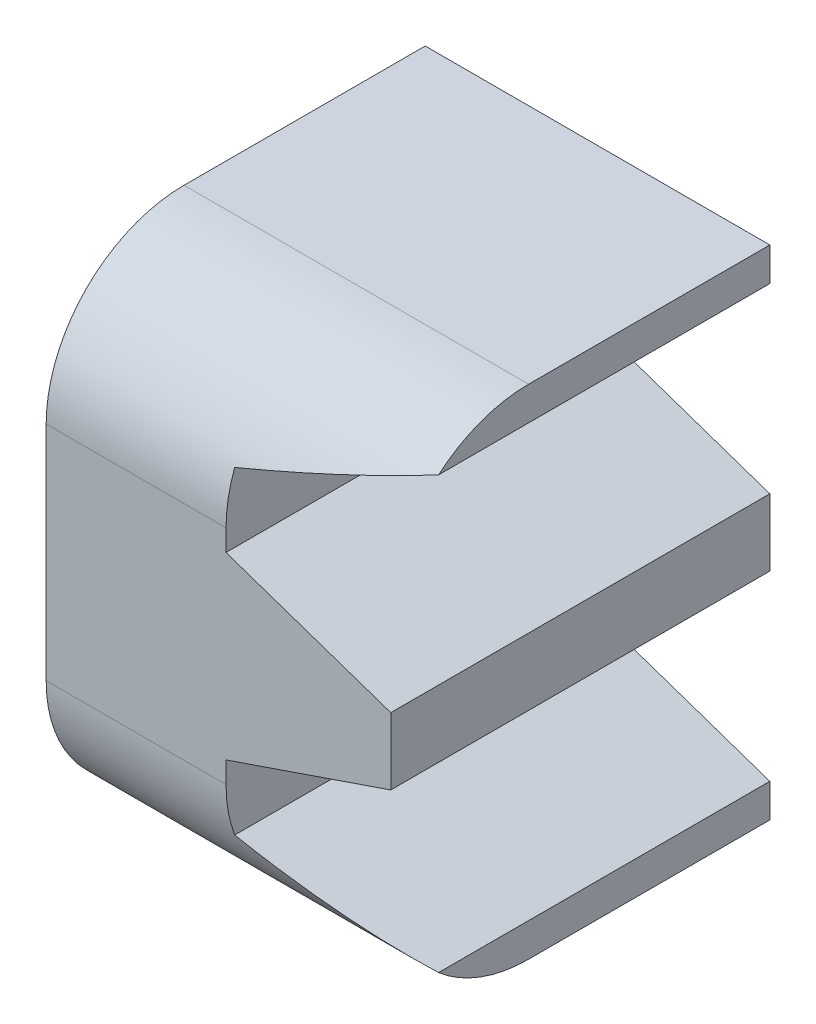
ISO-10303-21;
HEADER;
FILE_DESCRIPTION(('STEP AP214'),'2;1');
FILE_NAME('part.step','',(''),(''),'','','');
FILE_SCHEMA(('AUTOMOTIVE_DESIGN { 1 0 10303 214 1 1 1 1 }'));
ENDSEC;
DATA;
#1=APPLICATION_CONTEXT('core data for automotive mechanical design processes');
#2=APPLICATION_PROTOCOL_DEFINITION('international standard','automotive_design',2000,#1);
#3=PRODUCT_CONTEXT('',#1,'mechanical');
#4=PRODUCT('Part','Part','',(#3));
#5=PRODUCT_RELATED_PRODUCT_CATEGORY('part','',(#4));
#6=PRODUCT_DEFINITION_FORMATION('','',#4);
#7=PRODUCT_DEFINITION_CONTEXT('part definition',#1,'design');
#8=PRODUCT_DEFINITION('design','',#6,#7);
#9=PRODUCT_DEFINITION_SHAPE('','',#8);
#10=(LENGTH_UNIT() NAMED_UNIT(*) SI_UNIT(.MILLI.,.METRE.));
#11=(NAMED_UNIT(*) PLANE_ANGLE_UNIT() SI_UNIT($,.RADIAN.));
#12=(NAMED_UNIT(*) SI_UNIT($,.STERADIAN.) SOLID_ANGLE_UNIT());
#13=UNCERTAINTY_MEASURE_WITH_UNIT(LENGTH_MEASURE(1.E-05),#10,'distance_accuracy_value','');
#14=(GEOMETRIC_REPRESENTATION_CONTEXT(3) GLOBAL_UNCERTAINTY_ASSIGNED_CONTEXT((#13)) GLOBAL_UNIT_ASSIGNED_CONTEXT((#10,
#11,#12)) REPRESENTATION_CONTEXT('',''));
#15=CARTESIAN_POINT('',(0.,0.,0.));
#16=DIRECTION('',(0.,0.,1.));
#17=DIRECTION('',(1.,0.,0.));
#18=AXIS2_PLACEMENT_3D('',#15,#16,#17);
#19=CARTESIAN_POINT('',(2.75497762602042,-3.61288291082135,5.5));
#20=DIRECTION('',(0.,-1.,0.));
#21=DIRECTION('',(0.,0.,-1.));
#22=AXIS2_PLACEMENT_3D('',#19,#20,#21);
#23=PLANE('',#22);
#24=DIRECTION('',(0.,0.,-1.));
#25=VECTOR('',#24,1.);
#26=CARTESIAN_POINT('',(2.75497762602042,-3.61288291082135,5.5));
#27=LINE('',#26,#25);
#28=CARTESIAN_POINT('',(2.75497762602042,-3.61288291082135,3.5));
#29=VERTEX_POINT('',#28);
#30=CARTESIAN_POINT('',(2.75497762602042,-3.61288291082135,0.));
#31=VERTEX_POINT('',#30);
#32=EDGE_CURVE('E200',#29,#31,#27,.T.);
#33=ORIENTED_EDGE('',*,*,#32,.F.);
#34=DIRECTION('',(-1.,0.,0.));
#35=VECTOR('',#34,1.);
#36=CARTESIAN_POINT('',(-2.24502101432305,-3.61288291082135,3.5));
#37=LINE('',#36,#35);
#38=CARTESIAN_POINT('',(-2.24502101432305,-3.61288291082135,3.5));
#39=VERTEX_POINT('',#38);
#40=EDGE_CURVE('E202',#29,#39,#37,.T.);
#41=ORIENTED_EDGE('',*,*,#40,.T.);
#42=DIRECTION('',(0.,0.,-1.));
#43=VECTOR('',#42,1.);
#44=CARTESIAN_POINT('',(-2.24502101432305,-3.61288291082135,5.5));
#45=LINE('',#44,#43);
#46=CARTESIAN_POINT('',(-2.24502101432305,-3.61288291082135,0.));
#47=VERTEX_POINT('',#46);
#48=EDGE_CURVE('E170',#39,#47,#45,.T.);
#49=ORIENTED_EDGE('',*,*,#48,.T.);
#50=DIRECTION('',(-1.,0.,0.));
#51=VECTOR('',#50,1.);
#52=CARTESIAN_POINT('',(2.75497762602042,-3.61288291082135,0.));
#53=LINE('',#52,#51);
#54=EDGE_CURVE('E171',#31,#47,#53,.T.);
#55=ORIENTED_EDGE('',*,*,#54,.F.);
#56=EDGE_LOOP('',(#33,#41,#49,#55));
#57=FACE_BOUND('',#56,.T.);
#58=ADVANCED_FACE('F32',(#57),#23,.T.);
#59=CARTESIAN_POINT('',(2.75497762602042,-3.61288291082135,5.5));
#60=DIRECTION('',(-1.,0.,0.));
#61=DIRECTION('',(0.,0.,1.));
#62=AXIS2_PLACEMENT_3D('',#59,#60,#61);
#63=PLANE('',#62);
#64=DIRECTION('',(0.,0.,-1.));
#65=VECTOR('',#64,1.);
#66=CARTESIAN_POINT('',(2.75497762602042,-3.12702062488493,5.5));
#67=LINE('',#66,#65);
#68=CARTESIAN_POINT('',(2.75497762602042,-3.12702062488493,4.8066701890111));
#69=VERTEX_POINT('',#68);
#70=CARTESIAN_POINT('',(2.75497762602042,-3.12702062488493,0.));
#71=VERTEX_POINT('',#70);
#72=EDGE_CURVE('E203',#69,#71,#67,.T.);
#73=ORIENTED_EDGE('',*,*,#72,.F.);
#74=CARTESIAN_POINT('',(2.75497762602042,-1.61288291082135,3.5));
#75=DIRECTION('',(-1.,0.,0.));
#76=DIRECTION('',(0.,0.,1.));
#77=AXIS2_PLACEMENT_3D('',#74,#75,#76);
#78=CIRCLE('',#77,2.);
#79=EDGE_CURVE('E236',#69,#29,#78,.F.);
#80=ORIENTED_EDGE('',*,*,#79,.T.);
#81=ORIENTED_EDGE('',*,*,#32,.T.);
#82=DIRECTION('',(0.,1.,0.));
#83=VECTOR('',#82,1.);
#84=CARTESIAN_POINT('',(2.75497762602042,-3.61288291082135,0.));
#85=LINE('',#84,#83);
#86=EDGE_CURVE('E162',#31,#71,#85,.T.);
#87=ORIENTED_EDGE('',*,*,#86,.T.);
#88=EDGE_LOOP('',(#73,#80,#81,#87));
#89=FACE_BOUND('',#88,.T.);
#90=ADVANCED_FACE('F264',(#89),#63,.F.);
#91=CARTESIAN_POINT('',(2.75497762602042,-3.12702062488493,5.5));
#92=DIRECTION('',(-0.323615577118184,-0.946188648339466,0.));
#93=DIRECTION('',(0.946188648339466,-0.323615577118184,0.));
#94=AXIS2_PLACEMENT_3D('',#91,#92,#93);
#95=PLANE('',#94);
#96=DIRECTION('',(0.,0.,-1.));
#97=VECTOR('',#96,1.);
#98=CARTESIAN_POINT('',(0.364622856972072,-2.30947114417583,5.5));
#99=LINE('',#98,#97);
#100=CARTESIAN_POINT('',(0.364622856972072,-2.30947114417583,5.37477060814173));
#101=VERTEX_POINT('',#100);
#102=CARTESIAN_POINT('',(0.364622856972072,-2.30947114417583,0.));
#103=VERTEX_POINT('',#102);
#104=EDGE_CURVE('E205',#101,#103,#99,.T.);
#105=ORIENTED_EDGE('',*,*,#104,.F.);
#106=CARTESIAN_POINT('',(-1.67206488481157,-1.61288291082135,3.5));
#107=DIRECTION('',(-0.323615577118184,-0.946188648339466,0.));
#108=DIRECTION('',(0.946188648339466,-0.323615577118184,0.));
#109=AXIS2_PLACEMENT_3D('',#106,#107,#108);
#110=ELLIPSE('',#109,6.18017222103497,2.);
#111=EDGE_CURVE('E234',#101,#69,#110,.F.);
#112=ORIENTED_EDGE('',*,*,#111,.T.);
#113=ORIENTED_EDGE('',*,*,#72,.T.);
#114=DIRECTION('',(-0.946188648339466,0.323615577118184,0.));
#115=VECTOR('',#114,1.);
#116=CARTESIAN_POINT('',(2.75497762602042,-3.12702062488493,0.));
#117=LINE('',#116,#115);
#118=EDGE_CURVE('E195',#71,#103,#117,.T.);
#119=ORIENTED_EDGE('',*,*,#118,.T.);
#120=EDGE_LOOP('',(#105,#112,#113,#119));
#121=FACE_BOUND('',#120,.T.);
#122=ADVANCED_FACE('F272',(#121),#95,.F.);
#123=CARTESIAN_POINT('',(0.364622856972072,-2.30947114417583,5.5));
#124=DIRECTION('',(-1.,0.,0.));
#125=DIRECTION('',(0.,0.,1.));
#126=AXIS2_PLACEMENT_3D('',#123,#124,#125);
#127=PLANE('',#126);
#128=DIRECTION('',(0.,1.,0.));
#129=VECTOR('',#128,1.);
#130=CARTESIAN_POINT('',(0.364622856972072,-2.30947114417583,5.5));
#131=LINE('',#130,#129);
#132=CARTESIAN_POINT('',(0.364622856972072,-1.61288291082135,5.5));
#133=VERTEX_POINT('',#132);
#134=CARTESIAN_POINT('',(0.364622856972072,-1.30341176664553,5.5));
#135=VERTEX_POINT('',#134);
#136=EDGE_CURVE('E168',#133,#135,#131,.T.);
#137=ORIENTED_EDGE('',*,*,#136,.F.);
#138=CARTESIAN_POINT('',(0.364622856972072,-1.61288291082135,3.5));
#139=DIRECTION('',(-1.,0.,0.));
#140=DIRECTION('',(0.,0.,1.));
#141=AXIS2_PLACEMENT_3D('',#138,#139,#140);
#142=CIRCLE('',#141,2.);
#143=EDGE_CURVE('E232',#133,#101,#142,.F.);
#144=ORIENTED_EDGE('',*,*,#143,.T.);
#145=ORIENTED_EDGE('',*,*,#104,.T.);
#146=DIRECTION('',(0.,1.,0.));
#147=VECTOR('',#146,1.);
#148=CARTESIAN_POINT('',(0.364622856972072,-2.30947114417583,0.));
#149=LINE('',#148,#147);
#150=CARTESIAN_POINT('',(0.364622856972072,-1.30341176664553,0.));
#151=VERTEX_POINT('',#150);
#152=EDGE_CURVE('E193',#103,#151,#149,.T.);
#153=ORIENTED_EDGE('',*,*,#152,.T.);
#154=DIRECTION('',(0.,0.,-1.));
#155=VECTOR('',#154,1.);
#156=CARTESIAN_POINT('',(0.364622856972072,-1.30341176664553,5.5));
#157=LINE('',#156,#155);
#158=EDGE_CURVE('E207',#135,#151,#157,.T.);
#159=ORIENTED_EDGE('',*,*,#158,.F.);
#160=EDGE_LOOP('',(#137,#144,#145,#153,#159));
#161=FACE_BOUND('',#160,.T.);
#162=ADVANCED_FACE('F276',(#161),#127,.F.);
#163=CARTESIAN_POINT('',(0.364622856972072,-1.30341176664553,5.5));
#164=DIRECTION('',(-0.323615577118184,0.946188648339466,0.));
#165=DIRECTION('',(-0.946188648339466,-0.323615577118184,0.));
#166=AXIS2_PLACEMENT_3D('',#163,#164,#165);
#167=PLANE('',#166);
#168=DIRECTION('',(0.946188648339466,0.323615577118184,0.));
#169=VECTOR('',#168,1.);
#170=CARTESIAN_POINT('',(0.364622856972072,-1.30341176664553,0.));
#171=LINE('',#170,#169);
#172=CARTESIAN_POINT('',(2.75497762602042,-0.48586228593642,0.));
#173=VERTEX_POINT('',#172);
#174=EDGE_CURVE('E191',#151,#173,#171,.T.);
#175=ORIENTED_EDGE('',*,*,#174,.T.);
#176=DIRECTION('',(0.,0.,-1.));
#177=VECTOR('',#176,1.);
#178=CARTESIAN_POINT('',(2.75497762602042,-0.48586228593642,5.5));
#179=LINE('',#178,#177);
#180=CARTESIAN_POINT('',(2.75497762602042,-0.48586228593642,5.5));
#181=VERTEX_POINT('',#180);
#182=EDGE_CURVE('E210',#181,#173,#179,.T.);
#183=ORIENTED_EDGE('',*,*,#182,.F.);
#184=DIRECTION('',(0.946188648339466,0.323615577118184,0.));
#185=VECTOR('',#184,1.);
#186=CARTESIAN_POINT('',(0.364622856972072,-1.30341176664553,5.5));
#187=LINE('',#186,#185);
#188=EDGE_CURVE('E166',#135,#181,#187,.T.);
#189=ORIENTED_EDGE('',*,*,#188,.F.);
#190=ORIENTED_EDGE('',*,*,#158,.T.);
#191=EDGE_LOOP('',(#175,#183,#189,#190));
#192=FACE_BOUND('',#191,.T.);
#193=ADVANCED_FACE('F281',(#192),#167,.F.);
#194=CARTESIAN_POINT('',(2.75497762602042,-0.48586228593642,5.5));
#195=DIRECTION('',(-1.,0.,0.));
#196=DIRECTION('',(0.,0.,1.));
#197=AXIS2_PLACEMENT_3D('',#194,#195,#196);
#198=PLANE('',#197);
#199=DIRECTION('',(0.,1.,0.));
#200=VECTOR('',#199,1.);
#201=CARTESIAN_POINT('',(2.75497762602042,-0.48586228593642,0.));
#202=LINE('',#201,#200);
#203=CARTESIAN_POINT('',(2.75497762602042,0.485862285936412,0.));
#204=VERTEX_POINT('',#203);
#205=EDGE_CURVE('E189',#173,#204,#202,.T.);
#206=ORIENTED_EDGE('',*,*,#205,.T.);
#207=DIRECTION('',(0.,0.,-1.));
#208=VECTOR('',#207,1.);
#209=CARTESIAN_POINT('',(2.75497762602042,0.485862285936412,5.5));
#210=LINE('',#209,#208);
#211=CARTESIAN_POINT('',(2.75497762602042,0.485862285936412,5.5));
#212=VERTEX_POINT('',#211);
#213=EDGE_CURVE('E154',#212,#204,#210,.T.);
#214=ORIENTED_EDGE('',*,*,#213,.F.);
#215=DIRECTION('',(0.,1.,0.));
#216=VECTOR('',#215,1.);
#217=CARTESIAN_POINT('',(2.75497762602042,-0.48586228593642,5.5));
#218=LINE('',#217,#216);
#219=EDGE_CURVE('E141',#181,#212,#218,.T.);
#220=ORIENTED_EDGE('',*,*,#219,.F.);
#221=ORIENTED_EDGE('',*,*,#182,.T.);
#222=EDGE_LOOP('',(#206,#214,#220,#221));
#223=FACE_BOUND('',#222,.T.);
#224=ADVANCED_FACE('F284',(#223),#198,.F.);
#225=CARTESIAN_POINT('',(2.75497762602042,0.485862285936412,5.5));
#226=DIRECTION('',(-0.323615577118184,-0.946188648339465,0.));
#227=DIRECTION('',(0.946188648339465,-0.323615577118184,0.));
#228=AXIS2_PLACEMENT_3D('',#225,#226,#227);
#229=PLANE('',#228);
#230=DIRECTION('',(-0.946188648339465,0.323615577118184,0.));
#231=VECTOR('',#230,1.);
#232=CARTESIAN_POINT('',(2.75497762602042,0.485862285936412,0.));
#233=LINE('',#232,#231);
#234=CARTESIAN_POINT('',(0.364622856972072,1.30341176664552,0.));
#235=VERTEX_POINT('',#234);
#236=EDGE_CURVE('E150',#204,#235,#233,.T.);
#237=ORIENTED_EDGE('',*,*,#236,.T.);
#238=DIRECTION('',(0.,0.,-1.));
#239=VECTOR('',#238,1.);
#240=CARTESIAN_POINT('',(0.364622856972072,1.30341176664552,5.5));
#241=LINE('',#240,#239);
#242=CARTESIAN_POINT('',(0.364622856972072,1.30341176664552,5.5));
#243=VERTEX_POINT('',#242);
#244=EDGE_CURVE('E147',#243,#235,#241,.T.);
#245=ORIENTED_EDGE('',*,*,#244,.F.);
#246=DIRECTION('',(-0.946188648339465,0.323615577118184,0.));
#247=VECTOR('',#246,1.);
#248=CARTESIAN_POINT('',(2.75497762602042,0.485862285936412,5.5));
#249=LINE('',#248,#247);
#250=EDGE_CURVE('E132',#212,#243,#249,.T.);
#251=ORIENTED_EDGE('',*,*,#250,.F.);
#252=ORIENTED_EDGE('',*,*,#213,.T.);
#253=EDGE_LOOP('',(#237,#245,#251,#252));
#254=FACE_BOUND('',#253,.T.);
#255=ADVANCED_FACE('F148',(#254),#229,.F.);
#256=CARTESIAN_POINT('',(0.364622856972072,1.30341176664552,5.5));
#257=DIRECTION('',(-1.,0.,0.));
#258=DIRECTION('',(0.,0.,1.));
#259=AXIS2_PLACEMENT_3D('',#256,#257,#258);
#260=PLANE('',#259);
#261=DIRECTION('',(0.,0.,-1.));
#262=VECTOR('',#261,1.);
#263=CARTESIAN_POINT('',(0.364622856972072,2.30947114417582,5.5));
#264=LINE('',#263,#262);
#265=CARTESIAN_POINT('',(0.364622856972072,2.30947114417582,5.37477060814173));
#266=VERTEX_POINT('',#265);
#267=CARTESIAN_POINT('',(0.364622856972072,2.30947114417582,0.));
#268=VERTEX_POINT('',#267);
#269=EDGE_CURVE('E155',#266,#268,#264,.T.);
#270=ORIENTED_EDGE('',*,*,#269,.F.);
#271=CARTESIAN_POINT('',(0.364622856972072,1.61288291082135,3.5));
#272=DIRECTION('',(-1.,0.,0.));
#273=DIRECTION('',(0.,0.,1.));
#274=AXIS2_PLACEMENT_3D('',#271,#272,#273);
#275=CIRCLE('',#274,2.);
#276=CARTESIAN_POINT('',(0.364622856972072,1.61288291082135,5.5));
#277=VERTEX_POINT('',#276);
#278=EDGE_CURVE('E11',#266,#277,#275,.F.);
#279=ORIENTED_EDGE('',*,*,#278,.T.);
#280=DIRECTION('',(0.,1.,0.));
#281=VECTOR('',#280,1.);
#282=CARTESIAN_POINT('',(0.364622856972072,1.30341176664552,5.5));
#283=LINE('',#282,#281);
#284=EDGE_CURVE('E138',#243,#277,#283,.T.);
#285=ORIENTED_EDGE('',*,*,#284,.F.);
#286=ORIENTED_EDGE('',*,*,#244,.T.);
#287=DIRECTION('',(0.,1.,0.));
#288=VECTOR('',#287,1.);
#289=CARTESIAN_POINT('',(0.364622856972072,1.30341176664552,0.));
#290=LINE('',#289,#288);
#291=EDGE_CURVE('E186',#235,#268,#290,.T.);
#292=ORIENTED_EDGE('',*,*,#291,.T.);
#293=EDGE_LOOP('',(#270,#279,#285,#286,#292));
#294=FACE_BOUND('',#293,.T.);
#295=ADVANCED_FACE('F157',(#294),#260,.F.);
#296=CARTESIAN_POINT('',(0.364622856972072,2.30947114417582,5.5));
#297=DIRECTION('',(-0.323615577118185,0.946188648339465,0.));
#298=DIRECTION('',(-0.946188648339465,-0.323615577118185,0.));
#299=AXIS2_PLACEMENT_3D('',#296,#297,#298);
#300=PLANE('',#299);
#301=DIRECTION('',(0.,0.,-1.));
#302=VECTOR('',#301,1.);
#303=CARTESIAN_POINT('',(2.75497762602042,3.12702062488493,5.5));
#304=LINE('',#303,#302);
#305=CARTESIAN_POINT('',(2.75497762602042,3.12702062488493,4.8066701890111));
#306=VERTEX_POINT('',#305);
#307=CARTESIAN_POINT('',(2.75497762602042,3.12702062488493,0.));
#308=VERTEX_POINT('',#307);
#309=EDGE_CURVE('E215',#306,#308,#304,.T.);
#310=ORIENTED_EDGE('',*,*,#309,.F.);
#311=CARTESIAN_POINT('',(-1.67206488481156,1.61288291082135,3.5));
#312=DIRECTION('',(-0.323615577118185,0.946188648339465,0.));
#313=DIRECTION('',(-0.946188648339465,-0.323615577118185,0.));
#314=AXIS2_PLACEMENT_3D('',#311,#312,#313);
#315=ELLIPSE('',#314,6.18017222103495,2.);
#316=EDGE_CURVE('E40',#306,#266,#315,.F.);
#317=ORIENTED_EDGE('',*,*,#316,.T.);
#318=ORIENTED_EDGE('',*,*,#269,.T.);
#319=DIRECTION('',(0.946188648339465,0.323615577118185,0.));
#320=VECTOR('',#319,1.);
#321=CARTESIAN_POINT('',(0.364622856972072,2.30947114417582,0.));
#322=LINE('',#321,#320);
#323=EDGE_CURVE('E183',#268,#308,#322,.T.);
#324=ORIENTED_EDGE('',*,*,#323,.T.);
#325=EDGE_LOOP('',(#310,#317,#318,#324));
#326=FACE_BOUND('',#325,.T.);
#327=ADVANCED_FACE('F286',(#326),#300,.F.);
#328=CARTESIAN_POINT('',(2.75497762602042,3.12702062488493,5.5));
#329=DIRECTION('',(-1.,0.,0.));
#330=DIRECTION('',(0.,0.,1.));
#331=AXIS2_PLACEMENT_3D('',#328,#329,#330);
#332=PLANE('',#331);
#333=DIRECTION('',(0.,0.,-1.));
#334=VECTOR('',#333,1.);
#335=CARTESIAN_POINT('',(2.75497762602042,3.61288291082135,5.5));
#336=LINE('',#335,#334);
#337=CARTESIAN_POINT('',(2.75497762602042,3.61288291082135,3.5));
#338=VERTEX_POINT('',#337);
#339=CARTESIAN_POINT('',(2.75497762602042,3.61288291082135,0.));
#340=VERTEX_POINT('',#339);
#341=EDGE_CURVE('E217',#338,#340,#336,.T.);
#342=ORIENTED_EDGE('',*,*,#341,.F.);
#343=CARTESIAN_POINT('',(2.75497762602042,1.61288291082135,3.5));
#344=DIRECTION('',(-1.,0.,0.));
#345=DIRECTION('',(0.,0.,1.));
#346=AXIS2_PLACEMENT_3D('',#343,#344,#345);
#347=CIRCLE('',#346,2.);
#348=EDGE_CURVE('E54',#338,#306,#347,.F.);
#349=ORIENTED_EDGE('',*,*,#348,.T.);
#350=ORIENTED_EDGE('',*,*,#309,.T.);
#351=DIRECTION('',(0.,1.,0.));
#352=VECTOR('',#351,1.);
#353=CARTESIAN_POINT('',(2.75497762602042,3.12702062488493,0.));
#354=LINE('',#353,#352);
#355=EDGE_CURVE('E180',#308,#340,#354,.T.);
#356=ORIENTED_EDGE('',*,*,#355,.T.);
#357=EDGE_LOOP('',(#342,#349,#350,#356));
#358=FACE_BOUND('',#357,.T.);
#359=ADVANCED_FACE('F245',(#358),#332,.F.);
#360=CARTESIAN_POINT('',(2.75497762602042,3.61288291082135,5.5));
#361=DIRECTION('',(0.,-1.,0.));
#362=DIRECTION('',(0.,0.,-1.));
#363=AXIS2_PLACEMENT_3D('',#360,#361,#362);
#364=PLANE('',#363);
#365=DIRECTION('',(0.,0.,-1.));
#366=VECTOR('',#365,1.);
#367=CARTESIAN_POINT('',(-2.24502188187132,3.61288291082135,5.5));
#368=LINE('',#367,#366);
#369=CARTESIAN_POINT('',(-2.24502188187132,3.61288291082135,3.5));
#370=VERTEX_POINT('',#369);
#371=CARTESIAN_POINT('',(-2.24502188187132,3.61288291082135,0.));
#372=VERTEX_POINT('',#371);
#373=EDGE_CURVE('E219',#370,#372,#368,.T.);
#374=ORIENTED_EDGE('',*,*,#373,.F.);
#375=DIRECTION('',(-1.,0.,0.));
#376=VECTOR('',#375,1.);
#377=CARTESIAN_POINT('',(2.75497762602042,3.61288291082135,3.5));
#378=LINE('',#377,#376);
#379=EDGE_CURVE('E238',#370,#338,#378,.F.);
#380=ORIENTED_EDGE('',*,*,#379,.T.);
#381=ORIENTED_EDGE('',*,*,#341,.T.);
#382=DIRECTION('',(-1.,0.,0.));
#383=VECTOR('',#382,1.);
#384=CARTESIAN_POINT('',(2.75497762602042,3.61288291082135,0.));
#385=LINE('',#384,#383);
#386=EDGE_CURVE('E177',#340,#372,#385,.T.);
#387=ORIENTED_EDGE('',*,*,#386,.T.);
#388=EDGE_LOOP('',(#374,#380,#381,#387));
#389=FACE_BOUND('',#388,.T.);
#390=ADVANCED_FACE('F243',(#389),#364,.F.);
#391=CARTESIAN_POINT('',(-2.24502101432305,-3.61288291082135,5.5));
#392=DIRECTION('',(-0.999999999999993,-1.20063159285522E-07,0.));
#393=DIRECTION('',(1.20063159285522E-07,-0.999999999999993,0.));
#394=AXIS2_PLACEMENT_3D('',#391,#392,#393);
#395=PLANE('',#394);
#396=ORIENTED_EDGE('',*,*,#48,.F.);
#397=CARTESIAN_POINT('',(-2.24502125444937,-1.61288291082135,3.5));
#398=DIRECTION('',(-0.999999999999993,-1.20063159285522E-07,0.));
#399=DIRECTION('',(1.20063159285522E-07,-0.999999999999993,0.));
#400=AXIS2_PLACEMENT_3D('',#397,#398,#399);
#401=CIRCLE('',#400,2.);
#402=CARTESIAN_POINT('',(-2.24502125444936,-1.61288291082135,5.5));
#403=VERTEX_POINT('',#402);
#404=EDGE_CURVE('E226',#39,#403,#401,.T.);
#405=ORIENTED_EDGE('',*,*,#404,.T.);
#406=DIRECTION('',(-1.20063159285522E-07,0.999999999999993,0.));
#407=VECTOR('',#406,1.);
#408=CARTESIAN_POINT('',(-2.24502101432305,-3.61288291082135,5.5));
#409=LINE('',#408,#407);
#410=CARTESIAN_POINT('',(-2.245021641745,1.61288291082135,5.5));
#411=VERTEX_POINT('',#410);
#412=EDGE_CURVE('E159',#403,#411,#409,.T.);
#413=ORIENTED_EDGE('',*,*,#412,.T.);
#414=CARTESIAN_POINT('',(-2.245021641745,1.61288291082135,3.5));
#415=DIRECTION('',(-0.999999999999993,-1.20063159285522E-07,0.));
#416=DIRECTION('',(1.20063159285522E-07,-0.999999999999993,0.));
#417=AXIS2_PLACEMENT_3D('',#414,#415,#416);
#418=CIRCLE('',#417,2.);
#419=EDGE_CURVE('E224',#411,#370,#418,.T.);
#420=ORIENTED_EDGE('',*,*,#419,.T.);
#421=ORIENTED_EDGE('',*,*,#373,.T.);
#422=DIRECTION('',(-1.20063159285522E-07,0.999999999999993,0.));
#423=VECTOR('',#422,1.);
#424=CARTESIAN_POINT('',(-2.24502101432305,-3.61288291082135,0.));
#425=LINE('',#424,#423);
#426=EDGE_CURVE('E174',#47,#372,#425,.T.);
#427=ORIENTED_EDGE('',*,*,#426,.F.);
#428=EDGE_LOOP('',(#396,#405,#413,#420,#421,#427));
#429=FACE_BOUND('',#428,.T.);
#430=ADVANCED_FACE('F251',(#429),#395,.T.);
#431=CARTESIAN_POINT('',(0.,0.,5.5));
#432=DIRECTION('',(0.,0.,-1.));
#433=DIRECTION('',(-1.,0.,0.));
#434=AXIS2_PLACEMENT_3D('',#431,#432,#433);
#435=PLANE('',#434);
#436=ORIENTED_EDGE('',*,*,#412,.F.);
#437=DIRECTION('',(-1.,0.,0.));
#438=VECTOR('',#437,1.);
#439=CARTESIAN_POINT('',(2.75497762602042,-1.61288291082135,5.5));
#440=LINE('',#439,#438);
#441=EDGE_CURVE('E230',#403,#133,#440,.F.);
#442=ORIENTED_EDGE('',*,*,#441,.T.);
#443=ORIENTED_EDGE('',*,*,#136,.T.);
#444=ORIENTED_EDGE('',*,*,#188,.T.);
#445=ORIENTED_EDGE('',*,*,#219,.T.);
#446=ORIENTED_EDGE('',*,*,#250,.T.);
#447=ORIENTED_EDGE('',*,*,#284,.T.);
#448=DIRECTION('',(-1.,0.,0.));
#449=VECTOR('',#448,1.);
#450=CARTESIAN_POINT('',(0.,1.61288291082135,5.5));
#451=LINE('',#450,#449);
#452=EDGE_CURVE('E228',#277,#411,#451,.T.);
#453=ORIENTED_EDGE('',*,*,#452,.T.);
#454=EDGE_LOOP('',(#436,#442,#443,#444,#445,#446,#447,#453));
#455=FACE_BOUND('',#454,.T.);
#456=ADVANCED_FACE('F135',(#455),#435,.F.);
#457=CARTESIAN_POINT('',(0.,0.,0.));
#458=DIRECTION('',(0.,0.,-1.));
#459=DIRECTION('',(-1.,0.,0.));
#460=AXIS2_PLACEMENT_3D('',#457,#458,#459);
#461=PLANE('',#460);
#462=ORIENTED_EDGE('',*,*,#54,.T.);
#463=ORIENTED_EDGE('',*,*,#426,.T.);
#464=ORIENTED_EDGE('',*,*,#386,.F.);
#465=ORIENTED_EDGE('',*,*,#355,.F.);
#466=ORIENTED_EDGE('',*,*,#323,.F.);
#467=ORIENTED_EDGE('',*,*,#291,.F.);
#468=ORIENTED_EDGE('',*,*,#236,.F.);
#469=ORIENTED_EDGE('',*,*,#205,.F.);
#470=ORIENTED_EDGE('',*,*,#174,.F.);
#471=ORIENTED_EDGE('',*,*,#152,.F.);
#472=ORIENTED_EDGE('',*,*,#118,.F.);
#473=ORIENTED_EDGE('',*,*,#86,.F.);
#474=EDGE_LOOP('',(#462,#463,#464,#465,#466,#467,#468,#469,#470,#471,#472,#473));
#475=FACE_BOUND('',#474,.T.);
#476=ADVANCED_FACE('F267',(#475),#461,.T.);
#477=CARTESIAN_POINT('',(2.75497762602042,-1.61288291082135,3.5));
#478=DIRECTION('',(1.,0.,0.));
#479=DIRECTION('',(0.,0.,-1.));
#480=AXIS2_PLACEMENT_3D('',#477,#478,#479);
#481=CYLINDRICAL_SURFACE('',#480,2.);
#482=ORIENTED_EDGE('',*,*,#143,.F.);
#483=ORIENTED_EDGE('',*,*,#441,.F.);
#484=ORIENTED_EDGE('',*,*,#404,.F.);
#485=ORIENTED_EDGE('',*,*,#40,.F.);
#486=ORIENTED_EDGE('',*,*,#79,.F.);
#487=ORIENTED_EDGE('',*,*,#111,.F.);
#488=EDGE_LOOP('',(#482,#483,#484,#485,#486,#487));
#489=FACE_BOUND('',#488,.T.);
#490=ADVANCED_FACE('F256',(#489),#481,.T.);
#491=CARTESIAN_POINT('',(0.,1.61288291082135,3.5));
#492=DIRECTION('',(-1.,0.,0.));
#493=DIRECTION('',(0.,0.,1.));
#494=AXIS2_PLACEMENT_3D('',#491,#492,#493);
#495=CYLINDRICAL_SURFACE('',#494,2.);
#496=ORIENTED_EDGE('',*,*,#348,.F.);
#497=ORIENTED_EDGE('',*,*,#379,.F.);
#498=ORIENTED_EDGE('',*,*,#419,.F.);
#499=ORIENTED_EDGE('',*,*,#452,.F.);
#500=ORIENTED_EDGE('',*,*,#278,.F.);
#501=ORIENTED_EDGE('',*,*,#316,.F.);
#502=EDGE_LOOP('',(#496,#497,#498,#499,#500,#501));
#503=FACE_BOUND('',#502,.T.);
#504=ADVANCED_FACE('F34',(#503),#495,.T.);
#505=CLOSED_SHELL('',(#58,#90,#122,#162,#193,#224,#255,#295,#327,#359,#390,#430,#456,#476,#490,#504));
#506=MANIFOLD_SOLID_BREP('B2',#505);
#507=ADVANCED_BREP_SHAPE_REPRESENTATION('',(#18,#506),#14);
#508=SHAPE_DEFINITION_REPRESENTATION(#9,#507);
ENDSEC;
END-ISO-10303-21;
